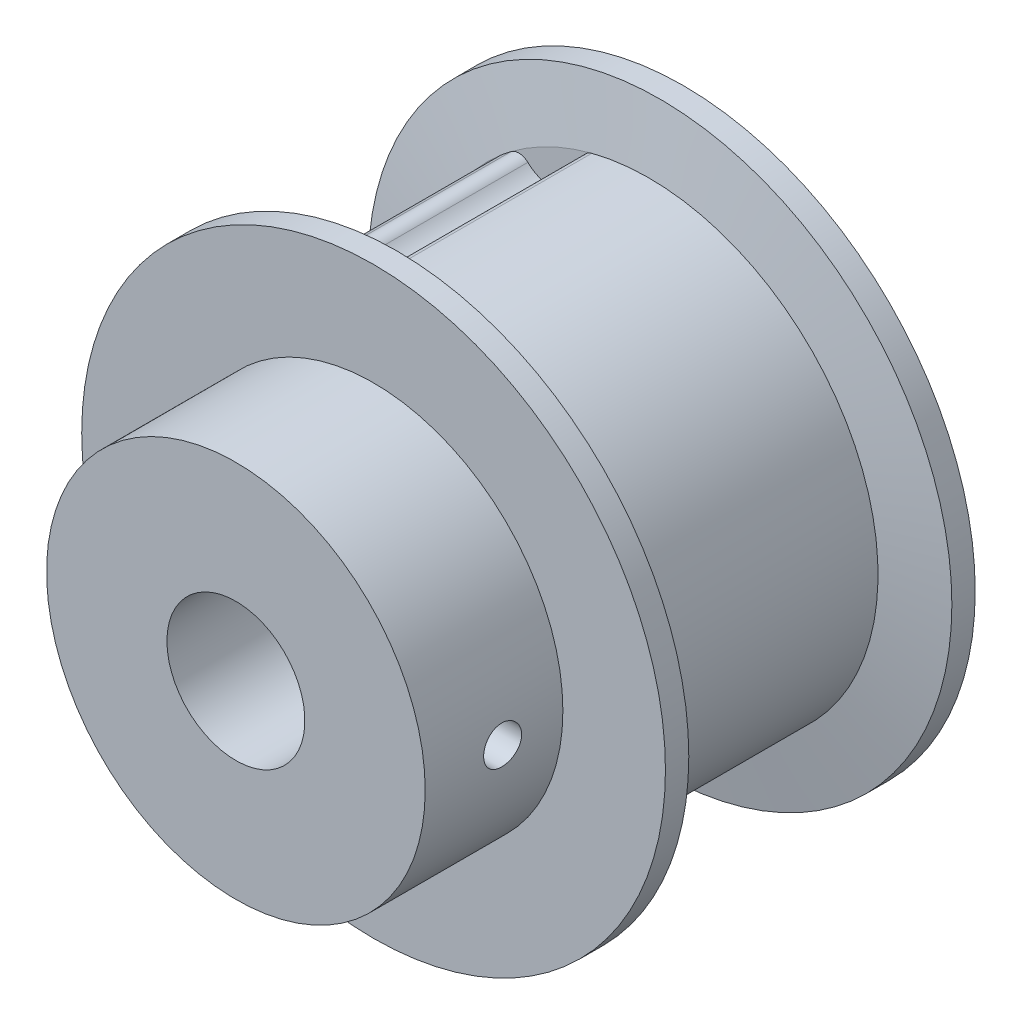
ISO-10303-21;
HEADER;
FILE_DESCRIPTION(('STEP AP214'),'2;1');
FILE_NAME('part.step','',(''),(''),'','','');
FILE_SCHEMA(('AUTOMOTIVE_DESIGN { 1 0 10303 214 1 1 1 1 }'));
ENDSEC;
DATA;
#1=APPLICATION_CONTEXT('core data for automotive mechanical design processes');
#2=APPLICATION_PROTOCOL_DEFINITION('international standard','automotive_design',2000,#1);
#3=PRODUCT_CONTEXT('',#1,'mechanical');
#4=PRODUCT('Part','Part','',(#3));
#5=PRODUCT_RELATED_PRODUCT_CATEGORY('part','',(#4));
#6=PRODUCT_DEFINITION_FORMATION('','',#4);
#7=PRODUCT_DEFINITION_CONTEXT('part definition',#1,'design');
#8=PRODUCT_DEFINITION('design','',#6,#7);
#9=PRODUCT_DEFINITION_SHAPE('','',#8);
#10=(LENGTH_UNIT() NAMED_UNIT(*) SI_UNIT(.MILLI.,.METRE.));
#11=(NAMED_UNIT(*) PLANE_ANGLE_UNIT() SI_UNIT($,.RADIAN.));
#12=(NAMED_UNIT(*) SI_UNIT($,.STERADIAN.) SOLID_ANGLE_UNIT());
#13=UNCERTAINTY_MEASURE_WITH_UNIT(LENGTH_MEASURE(1.E-05),#10,'distance_accuracy_value','');
#14=(GEOMETRIC_REPRESENTATION_CONTEXT(3) GLOBAL_UNCERTAINTY_ASSIGNED_CONTEXT((#13)) GLOBAL_UNIT_ASSIGNED_CONTEXT((#10,
#11,#12)) REPRESENTATION_CONTEXT('',''));
#15=CARTESIAN_POINT('',(0.,0.,0.));
#16=DIRECTION('',(0.,0.,1.));
#17=DIRECTION('',(1.,0.,0.));
#18=AXIS2_PLACEMENT_3D('',#15,#16,#17);
#19=CARTESIAN_POINT('',(0.,0.,13.49375));
#20=DIRECTION('',(0.,0.,1.));
#21=DIRECTION('',(1.,0.,0.));
#22=AXIS2_PLACEMENT_3D('',#19,#20,#21);
#23=PLANE('',#22);
#24=CARTESIAN_POINT('',(0.,0.,13.49375));
#25=DIRECTION('',(0.,0.,-1.));
#26=DIRECTION('',(-1.,0.,0.));
#27=AXIS2_PLACEMENT_3D('',#24,#25,#26);
#28=CIRCLE('',#27,3.18135);
#29=CARTESIAN_POINT('',(-3.18135,0.,13.49375));
#30=VERTEX_POINT('',#29);
#31=EDGE_CURVE('E430',#30,#30,#28,.T.);
#32=ORIENTED_EDGE('',*,*,#31,.T.);
#33=EDGE_LOOP('',(#32));
#34=FACE_BOUND('',#33,.T.);
#35=CARTESIAN_POINT('',(0.,0.,13.49375));
#36=DIRECTION('',(0.,0.,1.));
#37=DIRECTION('',(1.,0.,0.));
#38=AXIS2_PLACEMENT_3D('',#35,#36,#37);
#39=CIRCLE('',#38,8.73125);
#40=CARTESIAN_POINT('',(8.73125,0.,13.49375));
#41=VERTEX_POINT('',#40);
#42=EDGE_CURVE('E257',#41,#41,#39,.F.);
#43=ORIENTED_EDGE('',*,*,#42,.F.);
#44=EDGE_LOOP('',(#43));
#45=FACE_BOUND('',#44,.T.);
#46=ADVANCED_FACE('F16',(#34,#45),#23,.T.);
#47=CARTESIAN_POINT('',(0.,0.,9.921875));
#48=DIRECTION('',(-1.,0.,0.));
#49=DIRECTION('',(0.,0.,1.));
#50=AXIS2_PLACEMENT_3D('',#47,#48,#49);
#51=CYLINDRICAL_SURFACE('',#50,0.8763);
#52=CARTESIAN_POINT('',(3.18135,0.,9.045575));
#53=CARTESIAN_POINT('',(3.18134841128343,-0.0481893943951871,9.04557754429007));
#54=CARTESIAN_POINT('',(3.18024298845227,-0.0964335547292547,9.04956791922159));
#55=CARTESIAN_POINT('',(3.1759353654732,-0.191573484811042,9.06540831663995));
#56=CARTESIAN_POINT('',(3.17272934101652,-0.238466632063338,9.077272674836));
#57=CARTESIAN_POINT('',(3.16457466220837,-0.329449970853951,9.10844309631712));
#58=CARTESIAN_POINT('',(3.15962928961197,-0.373545257646135,9.12773515166962));
#59=CARTESIAN_POINT('',(3.14851760225123,-0.457859625360472,9.17316920470743));
#60=CARTESIAN_POINT('',(3.14235155403727,-0.498079549672782,9.19930970734763));
#61=CARTESIAN_POINT('',(3.12929072619131,-0.574513195352826,9.25838377064851));
#62=CARTESIAN_POINT('',(3.12238278346796,-0.61061784951194,9.2914555529729));
#63=CARTESIAN_POINT('',(3.1086994626396,-0.676846842823859,9.36315970856861));
#64=CARTESIAN_POINT('',(3.10192411036523,-0.706970026947473,9.40179315332408));
#65=CARTESIAN_POINT('',(3.08913865023835,-0.760917411740671,9.48440057553412));
#66=CARTESIAN_POINT('',(3.08314497886407,-0.784615059156058,9.52845997873882));
#67=CARTESIAN_POINT('',(3.07279466027877,-0.824222549668575,9.62012938590107));
#68=CARTESIAN_POINT('',(3.06843767702726,-0.840133991612145,9.66773865860032));
#69=CARTESIAN_POINT('',(3.06198946318021,-0.86333728324876,9.76395087965073));
#70=CARTESIAN_POINT('',(3.05984641038301,-0.870826661539665,9.81250263053884));
#71=CARTESIAN_POINT('',(3.05791403428716,-0.877589320778472,9.91021715350185));
#72=CARTESIAN_POINT('',(3.05812424135696,-0.876864241055676,9.95937980170605));
#73=CARTESIAN_POINT('',(3.06082836184337,-0.86737498103517,10.0553625355372));
#74=CARTESIAN_POINT('',(3.06325376749431,-0.85885194837192,10.1022087022432));
#75=CARTESIAN_POINT('',(3.07000504534929,-0.834395708839866,10.1937792124117));
#76=CARTESIAN_POINT('',(3.07433108991607,-0.818461829897933,10.2385033630279));
#77=CARTESIAN_POINT('',(3.08445515923665,-0.779444059813929,10.3251798679962));
#78=CARTESIAN_POINT('',(3.09027014540672,-0.756277055716914,10.3670927434637));
#79=CARTESIAN_POINT('',(3.10270754980193,-0.703510106023451,10.4465171446987));
#80=CARTESIAN_POINT('',(3.10933008550084,-0.673909224003207,10.4840280285496));
#81=CARTESIAN_POINT('',(3.12291891433506,-0.607896089575789,10.5549560963033));
#82=CARTESIAN_POINT('',(3.12988915724795,-0.571282941371303,10.5881858040724));
#83=CARTESIAN_POINT('',(3.14318526025427,-0.492901554098853,10.64808641099));
#84=CARTESIAN_POINT('',(3.1495108435139,-0.451131117240939,10.6747544993008));
#85=CARTESIAN_POINT('',(3.1608491773403,-0.363305959994821,10.7208650491048));
#86=CARTESIAN_POINT('',(3.16585434053572,-0.317228455148668,10.7402660088295));
#87=CARTESIAN_POINT('',(3.1739253063138,-0.222350425059078,10.7709555571985));
#88=CARTESIAN_POINT('',(3.17699512787984,-0.173555773330067,10.7822609639702));
#89=CARTESIAN_POINT('',(3.17972928272051,-0.103619486643986,10.7922759282538));
#90=CARTESIAN_POINT('',(3.18033546992572,-0.082965325340154,10.7944857857713));
#91=CARTESIAN_POINT('',(3.18114617161247,-0.0415441698215398,10.7974358721658));
#92=CARTESIAN_POINT('',(3.18135068498563,-0.0207771752955613,10.7981760969875));
#93=CARTESIAN_POINT('',(3.18134841128344,0.0481893943951848,10.7981724557099));
#94=CARTESIAN_POINT('',(3.18024298845228,0.0964335547292519,10.7941820807784));
#95=CARTESIAN_POINT('',(3.1759353654732,0.19157348481104,10.77834168336));
#96=CARTESIAN_POINT('',(3.17272934101652,0.238466632063337,10.766477325164));
#97=CARTESIAN_POINT('',(3.16457466220837,0.329449970853952,10.7353069036829));
#98=CARTESIAN_POINT('',(3.15962928961197,0.373545257646136,10.7160148483304));
#99=CARTESIAN_POINT('',(3.14851760225123,0.457859625360474,10.6705807952926));
#100=CARTESIAN_POINT('',(3.14235155403727,0.498079549672782,10.6444402926524));
#101=CARTESIAN_POINT('',(3.12929072619131,0.574513195352826,10.5853662293515));
#102=CARTESIAN_POINT('',(3.12238278346796,0.61061784951194,10.5522944470271));
#103=CARTESIAN_POINT('',(3.1086994626396,0.676846842823859,10.4805902914314));
#104=CARTESIAN_POINT('',(3.10192411036523,0.706970026947473,10.4419568466759));
#105=CARTESIAN_POINT('',(3.08913865023835,0.760917411740671,10.3593494244659));
#106=CARTESIAN_POINT('',(3.08314497886407,0.784615059156057,10.3152900212612));
#107=CARTESIAN_POINT('',(3.07279466027877,0.824222549668575,10.2236206140989));
#108=CARTESIAN_POINT('',(3.06843767702726,0.840133991612145,10.1760113413997));
#109=CARTESIAN_POINT('',(3.06198946318021,0.86333728324876,10.0797991203493));
#110=CARTESIAN_POINT('',(3.05984641038301,0.870826661539665,10.0312473694612));
#111=CARTESIAN_POINT('',(3.05791403428716,0.877589320778472,9.93353284649815));
#112=CARTESIAN_POINT('',(3.05812424135696,0.876864241055676,9.88437019829395));
#113=CARTESIAN_POINT('',(3.06082836184337,0.86737498103517,9.78838746446278));
#114=CARTESIAN_POINT('',(3.06325376749431,0.858851948371921,9.74154129775683));
#115=CARTESIAN_POINT('',(3.07000504534929,0.834395708839867,9.64997078758832));
#116=CARTESIAN_POINT('',(3.07433108991607,0.818461829897933,9.60524663697213));
#117=CARTESIAN_POINT('',(3.08445515923665,0.779444059813929,9.51857013200384));
#118=CARTESIAN_POINT('',(3.09027014540672,0.756277055716915,9.47665725653625));
#119=CARTESIAN_POINT('',(3.10270754980193,0.703510106023452,9.39723285530135));
#120=CARTESIAN_POINT('',(3.10933008550084,0.673909224003207,9.35972197145043));
#121=CARTESIAN_POINT('',(3.12291891433506,0.607896089575789,9.28879390369665));
#122=CARTESIAN_POINT('',(3.12988915724795,0.571282941371303,9.25556419592761));
#123=CARTESIAN_POINT('',(3.14318526025427,0.492901554098853,9.19566358901004));
#124=CARTESIAN_POINT('',(3.1495108435139,0.451131117240939,9.16899550069922));
#125=CARTESIAN_POINT('',(3.1608491773403,0.363305959994821,9.12288495089521));
#126=CARTESIAN_POINT('',(3.16585434053572,0.317228455148668,9.10348399117052));
#127=CARTESIAN_POINT('',(3.1739253063138,0.222350425059077,9.07279444280147));
#128=CARTESIAN_POINT('',(3.17699512787984,0.173555773330066,9.06148903602985));
#129=CARTESIAN_POINT('',(3.17972928272051,0.103619486643986,9.05147407174618));
#130=CARTESIAN_POINT('',(3.18033546992572,0.0829653253401542,9.04926421422868));
#131=CARTESIAN_POINT('',(3.18114617161247,0.0415441698215395,9.04631412783419));
#132=CARTESIAN_POINT('',(3.18135068498563,0.0207771752955602,9.04557390301255));
#133=CARTESIAN_POINT('',(3.18135,0.,9.045575));
#134=B_SPLINE_CURVE_WITH_KNOTS('',3,(#52,#53,#54,#55,#56,#57,#58,#59,#60,#61,#62,#63,#64,#65,
#66,#67,#68,#69,#70,#71,#72,#73,#74,#75,#76,#77,#78,#79,#80,#81,#82,#83,#84,#85,#86,#87,#88,#89,
#90,#91,#92,#93,#94,#95,#96,#97,#98,#99,#100,#101,#102,#103,#104,#105,#106,#107,#108,#109,#110,
#111,#112,#113,#114,#115,#116,#117,#118,#119,#120,#121,#122,#123,#124,#125,#126,#127,#128,#129,
#130,#131,#132,#133),.UNSPECIFIED.,.T.,.F.,(4,2,2,2,2,2,2,2,2,2,2,2,2,2,2,2,2,2,2,2,2,2,2,2,2,2,
2,2,2,2,2,2,2,2,2,2,2,2,2,2,4),(0.,0.144488377736948,0.289240541482826,0.433721043074943,
0.578170030204596,0.725833451323394,0.873525358759691,1.02394383604916,1.17433141291198,
1.32111306899122,1.46786543290902,1.61022753532876,1.75260255076833,1.8966778057285,
2.04077404429288,2.18987597815134,2.33904167287127,2.48904669860112,2.63873918472978,
2.7010361300674,2.76333324730844,2.90782162504539,3.05257378879127,3.19705429038339,
3.34150327751304,3.48916669863184,3.63685860606813,3.78727708335761,3.93766466022042,
4.08444631629966,4.23119868021747,4.3735607826372,4.51593579807677,4.66001105303694,
4.80410729160133,4.95320922545978,5.10237492017971,5.25237994590956,5.40207243203822,
5.46436937737585,5.52666649461689),.UNSPECIFIED.);
#135=CARTESIAN_POINT('',(3.18135,0.,9.045575));
#136=VERTEX_POINT('',#135);
#137=EDGE_CURVE('E19',#136,#136,#134,.T.);
#138=ORIENTED_EDGE('',*,*,#137,.T.);
#139=EDGE_LOOP('',(#138));
#140=FACE_BOUND('',#139,.T.);
#141=CARTESIAN_POINT('',(8.73125,0.,10.798175));
#142=CARTESIAN_POINT('',(8.73124910036505,0.0490599260598818,10.7981710471338));
#143=CARTESIAN_POINT('',(8.73083194377037,0.0981611052276523,10.7940398514306));
#144=CARTESIAN_POINT('',(8.72920628542201,0.195047567693096,10.7776092950651));
#145=CARTESIAN_POINT('',(8.72799612106251,0.242829866020774,10.7652927724224));
#146=CARTESIAN_POINT('',(8.72492138404998,0.335596285002959,10.7328543844939));
#147=CARTESIAN_POINT('',(8.72305745719067,0.380583115615679,10.7127402197469));
#148=CARTESIAN_POINT('',(8.71888396161317,0.466521240776585,10.6652916869772));
#149=CARTESIAN_POINT('',(8.71657458734335,0.507474284427691,10.6379604674561));
#150=CARTESIAN_POINT('',(8.71175897568934,0.584356974756563,10.576742225632));
#151=CARTESIAN_POINT('',(8.70925211089828,0.620269513468087,10.5428337647352));
#152=CARTESIAN_POINT('',(8.70432914759082,0.685905822298732,10.4694677969302));
#153=CARTESIAN_POINT('',(8.70191305772755,0.71562900363734,10.4300097627005));
#154=CARTESIAN_POINT('',(8.69743915546719,0.76809901236908,10.3465628060867));
#155=CARTESIAN_POINT('',(8.69538211255125,0.790830934149677,10.3025644665244));
#156=CARTESIAN_POINT('',(8.69186671880915,0.828577701415579,10.2113515062519));
#157=CARTESIAN_POINT('',(8.69040834786573,0.843592806214576,10.1641369936774));
#158=CARTESIAN_POINT('',(8.6882608950464,0.865430771221417,10.0680009563374));
#159=CARTESIAN_POINT('',(8.68756922722907,0.872281175303693,10.0190857470887));
#160=CARTESIAN_POINT('',(8.68702546344219,0.877680421406713,9.9207952575065));
#161=CARTESIAN_POINT('',(8.6871733467379,0.876229468449398,9.87141998856539));
#162=CARTESIAN_POINT('',(8.68828961316532,0.865089912220661,9.77380140890658));
#163=CARTESIAN_POINT('',(8.68925499285887,0.855431462401511,9.72555461810784));
#164=CARTESIAN_POINT('',(8.69189279949484,0.828197853454266,9.63136986202329));
#165=CARTESIAN_POINT('',(8.69356524248193,0.810622514675772,9.58543194915694));
#166=CARTESIAN_POINT('',(8.69743225435607,0.768020037687419,9.49707271573068));
#167=CARTESIAN_POINT('',(8.69962777664596,0.742979271243872,9.45465800946672));
#168=CARTESIAN_POINT('',(8.70429252590947,0.686168851401518,9.3746254294583));
#169=CARTESIAN_POINT('',(8.70676173833957,0.654399555465836,9.33700730105853));
#170=CARTESIAN_POINT('',(8.71170872306345,0.584871615147312,9.26746316235356));
#171=CARTESIAN_POINT('',(8.7141864871327,0.547088088119497,9.23556202486407));
#172=CARTESIAN_POINT('',(8.71886266553508,0.466669026701758,9.17853652384356));
#173=CARTESIAN_POINT('',(8.72106095019883,0.424031257364837,9.1534152999471));
#174=CARTESIAN_POINT('',(8.72493154178951,0.335081528024233,9.11066557515421));
#175=CARTESIAN_POINT('',(8.72660332211766,0.288765947140964,9.09304456967051));
#176=CARTESIAN_POINT('',(8.72922523155603,0.193889002865032,9.06587576932256));
#177=CARTESIAN_POINT('',(8.7301768908388,0.145332635307131,9.05631085129871));
#178=CARTESIAN_POINT('',(8.73107197375254,0.0643625993434024,9.04734667207088));
#179=CARTESIAN_POINT('',(8.73125059028648,0.0321901798094672,9.0455724063664));
#180=CARTESIAN_POINT('',(8.73124910036505,-0.0490599260598827,9.04557895286617));
#181=CARTESIAN_POINT('',(8.73083194377037,-0.0981611052276533,9.04971014856944));
#182=CARTESIAN_POINT('',(8.72920628542201,-0.195047567693097,9.06614070493494));
#183=CARTESIAN_POINT('',(8.72799612106251,-0.242829866020775,9.07845722757756));
#184=CARTESIAN_POINT('',(8.72492138404998,-0.33559628500296,9.11089561550606));
#185=CARTESIAN_POINT('',(8.72305745719067,-0.38058311561568,9.13100978025305));
#186=CARTESIAN_POINT('',(8.71888396161317,-0.466521240776586,9.17845831302283));
#187=CARTESIAN_POINT('',(8.71657458734335,-0.507474284427691,9.20578953254394));
#188=CARTESIAN_POINT('',(8.71175897568934,-0.584356974756564,9.26700777436799));
#189=CARTESIAN_POINT('',(8.70925211089828,-0.620269513468089,9.3009162352648));
#190=CARTESIAN_POINT('',(8.70432914759082,-0.685905822298734,9.37428220306979));
#191=CARTESIAN_POINT('',(8.70191305772755,-0.715629003637341,9.41374023729953));
#192=CARTESIAN_POINT('',(8.69743915546719,-0.76809901236908,9.49718719391333));
#193=CARTESIAN_POINT('',(8.69538211255125,-0.790830934149677,9.54118553347561));
#194=CARTESIAN_POINT('',(8.69186671880915,-0.828577701415579,9.63239849374809));
#195=CARTESIAN_POINT('',(8.69040834786573,-0.843592806214576,9.67961300632256));
#196=CARTESIAN_POINT('',(8.6882608950464,-0.865430771221417,9.77574904366259));
#197=CARTESIAN_POINT('',(8.68756922722907,-0.872281175303693,9.82466425291132));
#198=CARTESIAN_POINT('',(8.68702546344219,-0.877680421406713,9.9229547424935));
#199=CARTESIAN_POINT('',(8.6871733467379,-0.876229468449398,9.97233001143461));
#200=CARTESIAN_POINT('',(8.68828961316532,-0.865089912220661,10.0699485910934));
#201=CARTESIAN_POINT('',(8.68925499285887,-0.855431462401511,10.1181953818922));
#202=CARTESIAN_POINT('',(8.69189279949484,-0.828197853454266,10.2123801379767));
#203=CARTESIAN_POINT('',(8.69356524248193,-0.810622514675772,10.2583180508431));
#204=CARTESIAN_POINT('',(8.69743225435607,-0.768020037687419,10.3466772842693));
#205=CARTESIAN_POINT('',(8.69962777664596,-0.742979271243872,10.3890919905333));
#206=CARTESIAN_POINT('',(8.70429252590947,-0.686168851401518,10.4691245705417));
#207=CARTESIAN_POINT('',(8.70676173833957,-0.654399555465835,10.5067426989415));
#208=CARTESIAN_POINT('',(8.71170872306345,-0.584871615147311,10.5762868376464));
#209=CARTESIAN_POINT('',(8.7141864871327,-0.547088088119496,10.6081879751359));
#210=CARTESIAN_POINT('',(8.71886266553508,-0.466669026701757,10.6652134761564));
#211=CARTESIAN_POINT('',(8.72106095019883,-0.424031257364837,10.6903347000529));
#212=CARTESIAN_POINT('',(8.72493154178951,-0.335081528024233,10.7330844248458));
#213=CARTESIAN_POINT('',(8.72660332211766,-0.288765947140964,10.7507054303295));
#214=CARTESIAN_POINT('',(8.72922523155603,-0.193889002865031,10.7778742306774));
#215=CARTESIAN_POINT('',(8.7301768908388,-0.145332635307131,10.7874391487013));
#216=CARTESIAN_POINT('',(8.73107197375254,-0.0643625993434024,10.7964033279291));
#217=CARTESIAN_POINT('',(8.73125059028648,-0.0321901798094676,10.7981775936336));
#218=CARTESIAN_POINT('',(8.73125,0.,10.798175));
#219=B_SPLINE_CURVE_WITH_KNOTS('',3,(#141,#142,#143,#144,#145,#146,#147,#148,#149,#150,#151,
#152,#153,#154,#155,#156,#157,#158,#159,#160,#161,#162,#163,#164,#165,#166,#167,#168,#169,#170,
#171,#172,#173,#174,#175,#176,#177,#178,#179,#180,#181,#182,#183,#184,#185,#186,#187,#188,#189,
#190,#191,#192,#193,#194,#195,#196,#197,#198,#199,#200,#201,#202,#203,#204,#205,#206,#207,#208,
#209,#210,#211,#212,#213,#214,#215,#216,#217,#218),.UNSPECIFIED.,.T.,.F.,(4,2,2,2,2,2,2,2,2,2,2,
2,2,2,2,2,2,2,2,2,2,2,2,2,2,2,2,2,2,2,2,2,2,2,2,2,2,2,4),(0.,0.147077343312324,
0.294464037196071,0.441705549038897,0.588882931338588,0.73654835573108,0.884227820813253,
1.03221999529279,1.18020719636078,1.32769373195796,1.47517662503679,1.62212001295694,
1.76906673549103,1.91628337105351,2.06349218747452,2.21132668633078,2.359229527208,
2.50727983108364,2.65501465517008,2.75151798298479,2.89859532629711,3.04598202018086,
3.19322353202369,3.34040091432338,3.48806633871587,3.63574580379804,3.78373797827758,
3.93172517934557,4.07921171494276,4.22669460802158,4.37363799594173,4.52058471847582,
4.66780135403831,4.81501017045931,4.96284466931557,5.11074751019279,5.25879781406843,
5.40653263815486,5.50303596596958),.UNSPECIFIED.);
#220=CARTESIAN_POINT('',(8.73125,0.,10.798175));
#221=VERTEX_POINT('',#220);
#222=EDGE_CURVE('E134',#221,#221,#219,.T.);
#223=ORIENTED_EDGE('',*,*,#222,.F.);
#224=EDGE_LOOP('',(#223));
#225=FACE_BOUND('',#224,.T.);
#226=ADVANCED_FACE('F258',(#140,#225),#51,.F.);
#227=CARTESIAN_POINT('',(0.,0.,-6.67350464587232));
#228=DIRECTION('',(0.,0.,1.));
#229=DIRECTION('',(1.,0.,0.));
#230=AXIS2_PLACEMENT_3D('',#227,#228,#229);
#231=CYLINDRICAL_SURFACE('',#230,10.5664);
#232=DIRECTION('',(0.,0.,1.));
#233=VECTOR('',#232,1.);
#234=CARTESIAN_POINT('',(-6.81279382708512,8.07679696597752,5.55625));
#235=LINE('',#234,#233);
#236=CARTESIAN_POINT('',(-6.81279382793805,8.07679696525829,5.55625));
#237=VERTEX_POINT('',#236);
#238=CARTESIAN_POINT('',(-6.81279382793805,8.07679696525829,-5.55625));
#239=VERTEX_POINT('',#238);
#240=EDGE_CURVE('E152',#237,#239,#235,.F.);
#241=ORIENTED_EDGE('',*,*,#240,.F.);
#242=CARTESIAN_POINT('',(0.,0.,5.55625));
#243=DIRECTION('',(0.,0.,1.));
#244=DIRECTION('',(1.,0.,0.));
#245=AXIS2_PLACEMENT_3D('',#242,#243,#244);
#246=CIRCLE('',#245,10.5664);
#247=CARTESIAN_POINT('',(-6.35830555701132,8.43923926688077,5.55624999999999));
#248=VERTEX_POINT('',#247);
#249=EDGE_CURVE('E140',#237,#248,#246,.F.);
#250=ORIENTED_EDGE('',*,*,#249,.T.);
#251=DIRECTION('',(0.,0.,1.));
#252=VECTOR('',#251,1.);
#253=CARTESIAN_POINT('',(-6.35830555790211,8.43923926620915,5.55625));
#254=LINE('',#253,#252);
#255=CARTESIAN_POINT('',(-6.3583055570118,8.4392392668814,-5.55625));
#256=VERTEX_POINT('',#255);
#257=EDGE_CURVE('E149',#256,#248,#254,.T.);
#258=ORIENTED_EDGE('',*,*,#257,.F.);
#259=CARTESIAN_POINT('',(0.,0.,-5.55625));
#260=DIRECTION('',(0.,0.,1.));
#261=DIRECTION('',(1.,0.,0.));
#262=AXIS2_PLACEMENT_3D('',#259,#260,#261);
#263=CIRCLE('',#262,10.5664);
#264=EDGE_CURVE('E155',#256,#239,#263,.T.);
#265=ORIENTED_EDGE('',*,*,#264,.T.);
#266=EDGE_LOOP('',(#241,#250,#258,#265));
#267=FACE_BOUND('',#266,.T.);
#268=ADVANCED_FACE('F148',(#267),#231,.T.);
#269=CARTESIAN_POINT('',(0.,0.,-6.67350464587232));
#270=DIRECTION('',(0.,0.,1.));
#271=DIRECTION('',(1.,0.,0.));
#272=AXIS2_PLACEMENT_3D('',#269,#270,#271);
#273=CYLINDRICAL_SURFACE('',#272,10.5664);
#274=CARTESIAN_POINT('',(0.,0.,-5.55625));
#275=DIRECTION('',(0.,0.,1.));
#276=DIRECTION('',(1.,0.,0.));
#277=AXIS2_PLACEMENT_3D('',#274,#275,#276);
#278=CIRCLE('',#277,10.5664);
#279=CARTESIAN_POINT('',(-9.39028404790058,4.84472645871151,-5.55625));
#280=VERTEX_POINT('',#279);
#281=CARTESIAN_POINT('',(-9.64250600978946,4.32098215816429,-5.55625));
#282=VERTEX_POINT('',#281);
#283=EDGE_CURVE('E388',#280,#282,#278,.T.);
#284=ORIENTED_EDGE('',*,*,#283,.T.);
#285=DIRECTION('',(0.,0.,1.));
#286=VECTOR('',#285,1.);
#287=CARTESIAN_POINT('',(-9.64250600933228,4.32098215918119,5.55625));
#288=LINE('',#287,#286);
#289=CARTESIAN_POINT('',(-9.64250600978946,4.32098215816429,5.55625));
#290=VERTEX_POINT('',#289);
#291=EDGE_CURVE('E244',#290,#282,#288,.F.);
#292=ORIENTED_EDGE('',*,*,#291,.F.);
#293=CARTESIAN_POINT('',(0.,0.,5.55625));
#294=DIRECTION('',(0.,0.,1.));
#295=DIRECTION('',(1.,0.,0.));
#296=AXIS2_PLACEMENT_3D('',#293,#294,#295);
#297=CIRCLE('',#296,10.5664);
#298=CARTESIAN_POINT('',(-9.39028404790029,4.84472645871136,5.55625));
#299=VERTEX_POINT('',#298);
#300=EDGE_CURVE('E154',#290,#299,#297,.F.);
#301=ORIENTED_EDGE('',*,*,#300,.T.);
#302=DIRECTION('',(0.,0.,1.));
#303=VECTOR('',#302,1.);
#304=CARTESIAN_POINT('',(-9.39028404841109,4.84472645772086,5.55625));
#305=LINE('',#304,#303);
#306=EDGE_CURVE('E165',#280,#299,#305,.T.);
#307=ORIENTED_EDGE('',*,*,#306,.F.);
#308=EDGE_LOOP('',(#284,#292,#301,#307));
#309=FACE_BOUND('',#308,.T.);
#310=ADVANCED_FACE('F271',(#309),#273,.T.);
#311=CARTESIAN_POINT('',(0.,0.,13.49375));
#312=DIRECTION('',(0.,0.,-1.));
#313=DIRECTION('',(-1.,0.,0.));
#314=AXIS2_PLACEMENT_3D('',#311,#312,#313);
#315=CYLINDRICAL_SURFACE('',#314,3.18135);
#316=ORIENTED_EDGE('',*,*,#31,.F.);
#317=EDGE_LOOP('',(#316));
#318=FACE_BOUND('',#317,.T.);
#319=CARTESIAN_POINT('',(0.,0.,-7.14375));
#320=DIRECTION('',(0.,0.,-1.));
#321=DIRECTION('',(-1.,0.,0.));
#322=AXIS2_PLACEMENT_3D('',#319,#320,#321);
#323=CIRCLE('',#322,3.18135);
#324=CARTESIAN_POINT('',(-3.18135,0.,-7.14375));
#325=VERTEX_POINT('',#324);
#326=EDGE_CURVE('E236',#325,#325,#323,.T.);
#327=ORIENTED_EDGE('',*,*,#326,.T.);
#328=EDGE_LOOP('',(#327));
#329=FACE_BOUND('',#328,.T.);
#330=ORIENTED_EDGE('',*,*,#137,.F.);
#331=EDGE_LOOP('',(#330));
#332=FACE_BOUND('',#331,.T.);
#333=ADVANCED_FACE('F265',(#318,#329,#332),#315,.F.);
#334=CARTESIAN_POINT('',(0.,0.,7.14375));
#335=DIRECTION('',(0.,0.,1.));
#336=DIRECTION('',(1.,0.,0.));
#337=AXIS2_PLACEMENT_3D('',#334,#335,#336);
#338=CYLINDRICAL_SURFACE('',#337,8.73125);
#339=CARTESIAN_POINT('',(0.,0.,7.14375));
#340=DIRECTION('',(0.,0.,1.));
#341=DIRECTION('',(1.,0.,0.));
#342=AXIS2_PLACEMENT_3D('',#339,#340,#341);
#343=CIRCLE('',#342,8.73125);
#344=CARTESIAN_POINT('',(8.73125,0.,7.14375));
#345=VERTEX_POINT('',#344);
#346=EDGE_CURVE('E232',#345,#345,#343,.F.);
#347=ORIENTED_EDGE('',*,*,#346,.F.);
#348=EDGE_LOOP('',(#347));
#349=FACE_BOUND('',#348,.T.);
#350=ORIENTED_EDGE('',*,*,#42,.T.);
#351=EDGE_LOOP('',(#350));
#352=FACE_BOUND('',#351,.T.);
#353=ORIENTED_EDGE('',*,*,#222,.T.);
#354=EDGE_LOOP('',(#353));
#355=FACE_BOUND('',#354,.T.);
#356=ADVANCED_FACE('F261',(#349,#352,#355),#338,.T.);
#357=CARTESIAN_POINT('',(-5.99759399091706,7.960474732181,5.55625));
#358=DIRECTION('',(0.,0.,1.));
#359=DIRECTION('',(1.,0.,0.));
#360=AXIS2_PLACEMENT_3D('',#357,#358,#359);
#361=CYLINDRICAL_SURFACE('',#360,0.59944);
#362=CARTESIAN_POINT('',(-5.99759399091706,7.960474732181,-5.55625));
#363=DIRECTION('',(0.,0.,1.));
#364=DIRECTION('',(1.,0.,0.));
#365=AXIS2_PLACEMENT_3D('',#362,#363,#364);
#366=CIRCLE('',#365,0.59944);
#367=CARTESIAN_POINT('',(-5.58427408826013,8.39463480826761,-5.55625));
#368=VERTEX_POINT('',#367);
#369=EDGE_CURVE('E133',#368,#256,#366,.T.);
#370=ORIENTED_EDGE('',*,*,#369,.T.);
#371=ORIENTED_EDGE('',*,*,#257,.T.);
#372=CARTESIAN_POINT('',(-5.99759399091706,7.960474732181,5.55625));
#373=DIRECTION('',(0.,0.,1.));
#374=DIRECTION('',(1.,0.,0.));
#375=AXIS2_PLACEMENT_3D('',#372,#373,#374);
#376=CIRCLE('',#375,0.59944);
#377=CARTESIAN_POINT('',(-5.58427408826013,8.39463480826761,5.55625));
#378=VERTEX_POINT('',#377);
#379=EDGE_CURVE('E121',#248,#378,#376,.F.);
#380=ORIENTED_EDGE('',*,*,#379,.T.);
#381=DIRECTION('',(0.,0.,1.));
#382=VECTOR('',#381,1.);
#383=CARTESIAN_POINT('',(-5.58427408826038,8.3946348082677,5.55625));
#384=LINE('',#383,#382);
#385=EDGE_CURVE('E235',#378,#368,#384,.F.);
#386=ORIENTED_EDGE('',*,*,#385,.T.);
#387=EDGE_LOOP('',(#370,#371,#380,#386));
#388=FACE_BOUND('',#387,.T.);
#389=ADVANCED_FACE('F157',(#388),#361,.T.);
#390=CARTESIAN_POINT('',(-8.85756601008528,4.56988140093012,5.55625));
#391=DIRECTION('',(0.,0.,1.));
#392=DIRECTION('',(1.,0.,0.));
#393=AXIS2_PLACEMENT_3D('',#390,#391,#392);
#394=CYLINDRICAL_SURFACE('',#393,0.59944);
#395=CARTESIAN_POINT('',(-8.85756601008528,4.56988140093012,-5.55625));
#396=DIRECTION('',(0.,0.,1.));
#397=DIRECTION('',(1.,0.,0.));
#398=AXIS2_PLACEMENT_3D('',#395,#396,#397);
#399=CIRCLE('',#398,0.59944);
#400=CARTESIAN_POINT('',(-8.67355264249433,5.1403788979867,-5.55625));
#401=VERTEX_POINT('',#400);
#402=EDGE_CURVE('E160',#401,#280,#399,.T.);
#403=ORIENTED_EDGE('',*,*,#402,.T.);
#404=ORIENTED_EDGE('',*,*,#306,.T.);
#405=CARTESIAN_POINT('',(-8.85756601008528,4.56988140093012,5.55625));
#406=DIRECTION('',(0.,0.,1.));
#407=DIRECTION('',(1.,0.,0.));
#408=AXIS2_PLACEMENT_3D('',#405,#406,#407);
#409=CIRCLE('',#408,0.59944);
#410=CARTESIAN_POINT('',(-8.67355264249433,5.1403788979867,5.55625));
#411=VERTEX_POINT('',#410);
#412=EDGE_CURVE('E158',#299,#411,#409,.F.);
#413=ORIENTED_EDGE('',*,*,#412,.T.);
#414=DIRECTION('',(0.,0.,1.));
#415=VECTOR('',#414,1.);
#416=CARTESIAN_POINT('',(-8.67355264249442,5.14037889798672,5.55625));
#417=LINE('',#416,#415);
#418=EDGE_CURVE('E381',#411,#401,#417,.F.);
#419=ORIENTED_EDGE('',*,*,#418,.T.);
#420=EDGE_LOOP('',(#403,#404,#413,#419));
#421=FACE_BOUND('',#420,.T.);
#422=ADVANCED_FACE('F370',(#421),#394,.T.);
#423=CARTESIAN_POINT('',(-6.42629879427282,7.61859405981976,5.55625));
#424=DIRECTION('',(0.,0.,1.));
#425=DIRECTION('',(1.,0.,0.));
#426=AXIS2_PLACEMENT_3D('',#423,#424,#425);
#427=CYLINDRICAL_SURFACE('',#426,0.59944);
#428=DIRECTION('',(0.,0.,1.));
#429=VECTOR('',#428,1.);
#430=CARTESIAN_POINT('',(-6.94154590156664,7.31224665567665,5.55625));
#431=LINE('',#430,#429);
#432=CARTESIAN_POINT('',(-6.94154590156647,7.31224665567626,-5.55625));
#433=VERTEX_POINT('',#432);
#434=CARTESIAN_POINT('',(-6.94154590156647,7.31224665567626,5.55625));
#435=VERTEX_POINT('',#434);
#436=EDGE_CURVE('E412',#433,#435,#431,.T.);
#437=ORIENTED_EDGE('',*,*,#436,.T.);
#438=CARTESIAN_POINT('',(-6.42629879427282,7.61859405981976,5.55625));
#439=DIRECTION('',(0.,0.,1.));
#440=DIRECTION('',(1.,0.,0.));
#441=AXIS2_PLACEMENT_3D('',#438,#439,#440);
#442=CIRCLE('',#441,0.59944);
#443=EDGE_CURVE('E245',#435,#237,#442,.F.);
#444=ORIENTED_EDGE('',*,*,#443,.T.);
#445=ORIENTED_EDGE('',*,*,#240,.T.);
#446=CARTESIAN_POINT('',(-6.42629879427282,7.61859405981976,-5.55625));
#447=DIRECTION('',(0.,0.,1.));
#448=DIRECTION('',(1.,0.,0.));
#449=AXIS2_PLACEMENT_3D('',#446,#447,#448);
#450=CIRCLE('',#449,0.59944);
#451=EDGE_CURVE('E248',#239,#433,#450,.T.);
#452=ORIENTED_EDGE('',*,*,#451,.T.);
#453=EDGE_LOOP('',(#437,#444,#445,#452));
#454=FACE_BOUND('',#453,.T.);
#455=ADVANCED_FACE('F367',(#454),#427,.T.);
#456=CARTESIAN_POINT('',(-9.09547922697062,4.07584951553892,5.55625));
#457=DIRECTION('',(0.,0.,1.));
#458=DIRECTION('',(1.,0.,0.));
#459=AXIS2_PLACEMENT_3D('',#456,#457,#458);
#460=CYLINDRICAL_SURFACE('',#459,0.59944);
#461=DIRECTION('',(0.,0.,1.));
#462=VECTOR('',#461,1.);
#463=CARTESIAN_POINT('',(-9.42678167274081,3.57628270016176,5.55625));
#464=LINE('',#463,#462);
#465=CARTESIAN_POINT('',(-9.42678167274036,3.57628270016116,-5.55625));
#466=VERTEX_POINT('',#465);
#467=CARTESIAN_POINT('',(-9.42678167274036,3.57628270016116,5.55625));
#468=VERTEX_POINT('',#467);
#469=EDGE_CURVE('E231',#466,#468,#464,.T.);
#470=ORIENTED_EDGE('',*,*,#469,.T.);
#471=CARTESIAN_POINT('',(-9.09547922697062,4.07584951553892,5.55625));
#472=DIRECTION('',(0.,0.,1.));
#473=DIRECTION('',(1.,0.,0.));
#474=AXIS2_PLACEMENT_3D('',#471,#472,#473);
#475=CIRCLE('',#474,0.59944);
#476=EDGE_CURVE('E239',#468,#290,#475,.F.);
#477=ORIENTED_EDGE('',*,*,#476,.T.);
#478=ORIENTED_EDGE('',*,*,#291,.T.);
#479=CARTESIAN_POINT('',(-9.09547922697062,4.07584951553892,-5.55625));
#480=DIRECTION('',(0.,0.,1.));
#481=DIRECTION('',(1.,0.,0.));
#482=AXIS2_PLACEMENT_3D('',#479,#480,#481);
#483=CIRCLE('',#482,0.59944);
#484=EDGE_CURVE('E242',#282,#466,#483,.T.);
#485=ORIENTED_EDGE('',*,*,#484,.T.);
#486=EDGE_LOOP('',(#470,#477,#478,#485));
#487=FACE_BOUND('',#486,.T.);
#488=ADVANCED_FACE('F363',(#487),#460,.T.);
#489=CARTESIAN_POINT('',(0.,0.,-7.14375));
#490=DIRECTION('',(0.,0.,1.));
#491=DIRECTION('',(1.,0.,0.));
#492=AXIS2_PLACEMENT_3D('',#489,#490,#491);
#493=PLANE('',#492);
#494=ORIENTED_EDGE('',*,*,#326,.F.);
#495=EDGE_LOOP('',(#494));
#496=FACE_BOUND('',#495,.T.);
#497=CARTESIAN_POINT('',(0.,0.,-7.14375));
#498=DIRECTION('',(0.,0.,1.));
#499=DIRECTION('',(1.,0.,0.));
#500=AXIS2_PLACEMENT_3D('',#497,#498,#499);
#501=CIRCLE('',#500,13.462);
#502=CARTESIAN_POINT('',(13.462,0.,-7.14375));
#503=VERTEX_POINT('',#502);
#504=EDGE_CURVE('E216',#503,#503,#501,.T.);
#505=ORIENTED_EDGE('',*,*,#504,.F.);
#506=EDGE_LOOP('',(#505));
#507=FACE_BOUND('',#506,.T.);
#508=ADVANCED_FACE('F359',(#496,#507),#493,.F.);
#509=CARTESIAN_POINT('',(0.,0.,7.14375));
#510=DIRECTION('',(0.,0.,1.));
#511=DIRECTION('',(1.,0.,0.));
#512=AXIS2_PLACEMENT_3D('',#509,#510,#511);
#513=PLANE('',#512);
#514=ORIENTED_EDGE('',*,*,#346,.T.);
#515=EDGE_LOOP('',(#514));
#516=FACE_BOUND('',#515,.T.);
#517=CARTESIAN_POINT('',(0.,0.,7.14375));
#518=DIRECTION('',(0.,0.,1.));
#519=DIRECTION('',(1.,0.,0.));
#520=AXIS2_PLACEMENT_3D('',#517,#518,#519);
#521=CIRCLE('',#520,13.462);
#522=CARTESIAN_POINT('',(13.462,0.,7.14375));
#523=VERTEX_POINT('',#522);
#524=EDGE_CURVE('E204',#523,#523,#521,.F.);
#525=ORIENTED_EDGE('',*,*,#524,.F.);
#526=EDGE_LOOP('',(#525));
#527=FACE_BOUND('',#526,.T.);
#528=ADVANCED_FACE('F355',(#516,#527),#513,.T.);
#529=CARTESIAN_POINT('',(-4.41261724555812,9.62536824429232,5.55625));
#530=DIRECTION('',(0.,0.,1.));
#531=DIRECTION('',(1.,0.,0.));
#532=AXIS2_PLACEMENT_3D('',#529,#530,#531);
#533=CYLINDRICAL_SURFACE('',#532,1.69926);
#534=CARTESIAN_POINT('',(-4.41261724555812,9.62536824429232,-5.55625));
#535=DIRECTION('',(0.,0.,1.));
#536=DIRECTION('',(1.,0.,0.));
#537=AXIS2_PLACEMENT_3D('',#534,#535,#536);
#538=CIRCLE('',#537,1.69926);
#539=CARTESIAN_POINT('',(-3.86128292006528,8.01803660174445,-5.55625));
#540=VERTEX_POINT('',#539);
#541=EDGE_CURVE('E222',#368,#540,#538,.T.);
#542=ORIENTED_EDGE('',*,*,#541,.F.);
#543=ORIENTED_EDGE('',*,*,#385,.F.);
#544=CARTESIAN_POINT('',(-4.41261724555812,9.62536824429232,5.55625));
#545=DIRECTION('',(0.,0.,1.));
#546=DIRECTION('',(1.,0.,0.));
#547=AXIS2_PLACEMENT_3D('',#544,#545,#546);
#548=CIRCLE('',#547,1.69926);
#549=CARTESIAN_POINT('',(-3.86128292006528,8.01803660174445,5.55625));
#550=VERTEX_POINT('',#549);
#551=EDGE_CURVE('E128',#378,#550,#548,.T.);
#552=ORIENTED_EDGE('',*,*,#551,.T.);
#553=DIRECTION('',(0.,0.,1.));
#554=VECTOR('',#553,1.);
#555=CARTESIAN_POINT('',(-3.86128292006768,8.01803660174293,5.55625));
#556=LINE('',#555,#554);
#557=EDGE_CURVE('E210',#550,#540,#556,.F.);
#558=ORIENTED_EDGE('',*,*,#557,.T.);
#559=EDGE_LOOP('',(#542,#543,#552,#558));
#560=FACE_BOUND('',#559,.T.);
#561=ADVANCED_FACE('F351',(#560),#533,.F.);
#562=CARTESIAN_POINT('',(-8.1519215284332,6.75759426040548,5.55625));
#563=DIRECTION('',(0.,0.,1.));
#564=DIRECTION('',(1.,0.,0.));
#565=AXIS2_PLACEMENT_3D('',#562,#563,#564);
#566=CYLINDRICAL_SURFACE('',#565,1.69926);
#567=CARTESIAN_POINT('',(-8.1519215284332,6.75759426040548,-5.55625));
#568=DIRECTION('',(0.,0.,1.));
#569=DIRECTION('',(1.,0.,0.));
#570=AXIS2_PLACEMENT_3D('',#567,#568,#569);
#571=CIRCLE('',#570,1.69926);
#572=CARTESIAN_POINT('',(-6.95779140229249,5.5486534887205,-5.55625));
#573=VERTEX_POINT('',#572);
#574=EDGE_CURVE('E228',#401,#573,#571,.T.);
#575=ORIENTED_EDGE('',*,*,#574,.F.);
#576=ORIENTED_EDGE('',*,*,#418,.F.);
#577=CARTESIAN_POINT('',(-8.1519215284332,6.75759426040548,5.55625));
#578=DIRECTION('',(0.,0.,1.));
#579=DIRECTION('',(1.,0.,0.));
#580=AXIS2_PLACEMENT_3D('',#577,#578,#579);
#581=CIRCLE('',#580,1.69926);
#582=CARTESIAN_POINT('',(-6.95779140229249,5.5486534887205,5.55625));
#583=VERTEX_POINT('',#582);
#584=EDGE_CURVE('E199',#411,#583,#581,.T.);
#585=ORIENTED_EDGE('',*,*,#584,.T.);
#586=DIRECTION('',(0.,0.,1.));
#587=VECTOR('',#586,1.);
#588=CARTESIAN_POINT('',(-6.95779140229189,5.54865348872147,5.55625));
#589=LINE('',#588,#587);
#590=EDGE_CURVE('E415',#583,#573,#589,.F.);
#591=ORIENTED_EDGE('',*,*,#590,.T.);
#592=EDGE_LOOP('',(#575,#576,#585,#591));
#593=FACE_BOUND('',#592,.T.);
#594=ADVANCED_FACE('F347',(#593),#566,.F.);
#595=CARTESIAN_POINT('',(-8.40214045571596,6.44382964986128,5.55625));
#596=DIRECTION('',(0.,0.,1.));
#597=DIRECTION('',(1.,0.,0.));
#598=AXIS2_PLACEMENT_3D('',#595,#596,#597);
#599=CYLINDRICAL_SURFACE('',#598,1.69926);
#600=CARTESIAN_POINT('',(-8.40214045571596,6.44382964986128,-5.55625));
#601=DIRECTION('',(0.,0.,1.));
#602=DIRECTION('',(1.,0.,0.));
#603=AXIS2_PLACEMENT_3D('',#600,#601,#602);
#604=CIRCLE('',#603,1.69926);
#605=EDGE_CURVE('E225',#573,#433,#604,.T.);
#606=ORIENTED_EDGE('',*,*,#605,.F.);
#607=ORIENTED_EDGE('',*,*,#590,.F.);
#608=CARTESIAN_POINT('',(-8.40214045571596,6.44382964986128,5.55625));
#609=DIRECTION('',(0.,0.,1.));
#610=DIRECTION('',(1.,0.,0.));
#611=AXIS2_PLACEMENT_3D('',#608,#609,#610);
#612=CIRCLE('',#611,1.69926);
#613=EDGE_CURVE('E196',#583,#435,#612,.T.);
#614=ORIENTED_EDGE('',*,*,#613,.T.);
#615=ORIENTED_EDGE('',*,*,#436,.F.);
#616=EDGE_LOOP('',(#606,#607,#614,#615));
#617=FACE_BOUND('',#616,.T.);
#618=ADVANCED_FACE('F343',(#617),#599,.F.);
#619=CARTESIAN_POINT('',(-10.3659398770602,2.1601377870757,5.55625));
#620=DIRECTION('',(0.,0.,1.));
#621=DIRECTION('',(1.,0.,0.));
#622=AXIS2_PLACEMENT_3D('',#619,#620,#621);
#623=CYLINDRICAL_SURFACE('',#622,1.69926);
#624=CARTESIAN_POINT('',(-10.3659398770602,2.1601377870757,-5.55625));
#625=DIRECTION('',(0.,0.,1.));
#626=DIRECTION('',(1.,0.,0.));
#627=AXIS2_PLACEMENT_3D('',#624,#625,#626);
#628=CIRCLE('',#627,1.69926);
#629=CARTESIAN_POINT('',(-8.67622396557662,1.98029150249049,-5.55625));
#630=VERTEX_POINT('',#629);
#631=EDGE_CURVE('E211',#630,#466,#628,.T.);
#632=ORIENTED_EDGE('',*,*,#631,.F.);
#633=DIRECTION('',(0.,0.,1.));
#634=VECTOR('',#633,1.);
#635=CARTESIAN_POINT('',(-8.6762239655766,1.98029150249054,5.55625));
#636=LINE('',#635,#634);
#637=CARTESIAN_POINT('',(-8.67622396557662,1.98029150249049,5.55625));
#638=VERTEX_POINT('',#637);
#639=EDGE_CURVE('E184',#630,#638,#636,.T.);
#640=ORIENTED_EDGE('',*,*,#639,.T.);
#641=CARTESIAN_POINT('',(-10.3659398770602,2.1601377870757,5.55625));
#642=DIRECTION('',(0.,0.,1.));
#643=DIRECTION('',(1.,0.,0.));
#644=AXIS2_PLACEMENT_3D('',#641,#642,#643);
#645=CIRCLE('',#644,1.69926);
#646=EDGE_CURVE('E191',#638,#468,#645,.T.);
#647=ORIENTED_EDGE('',*,*,#646,.T.);
#648=ORIENTED_EDGE('',*,*,#469,.F.);
#649=EDGE_LOOP('',(#632,#640,#647,#648));
#650=FACE_BOUND('',#649,.T.);
#651=ADVANCED_FACE('F339',(#650),#623,.F.);
#652=CARTESIAN_POINT('',(0.,0.,-5.55625));
#653=DIRECTION('',(0.,0.,1.));
#654=DIRECTION('',(1.,0.,0.));
#655=AXIS2_PLACEMENT_3D('',#652,#653,#654);
#656=PLANE('',#655);
#657=ORIENTED_EDGE('',*,*,#451,.F.);
#658=CARTESIAN_POINT('',(0.,0.,-5.55624999999997));
#659=DIRECTION('',(0.,0.,-1.));
#660=DIRECTION('',(-1.,0.,0.));
#661=AXIS2_PLACEMENT_3D('',#658,#659,#660);
#662=CIRCLE('',#661,10.5663999999996);
#663=EDGE_CURVE('E181',#280,#239,#662,.T.);
#664=ORIENTED_EDGE('',*,*,#663,.F.);
#665=ORIENTED_EDGE('',*,*,#402,.F.);
#666=ORIENTED_EDGE('',*,*,#574,.T.);
#667=ORIENTED_EDGE('',*,*,#605,.T.);
#668=EDGE_LOOP('',(#657,#664,#665,#666,#667));
#669=FACE_BOUND('',#668,.T.);
#670=ADVANCED_FACE('F335',(#669),#656,.T.);
#671=CARTESIAN_POINT('',(0.,0.,-5.55625));
#672=DIRECTION('',(0.,0.,1.));
#673=DIRECTION('',(1.,0.,0.));
#674=AXIS2_PLACEMENT_3D('',#671,#672,#673);
#675=PLANE('',#674);
#676=CARTESIAN_POINT('',(-2.48431107198412,9.65238261462974,-5.55625));
#677=DIRECTION('',(0.,0.,1.));
#678=DIRECTION('',(1.,0.,0.));
#679=AXIS2_PLACEMENT_3D('',#676,#677,#678);
#680=CIRCLE('',#679,0.59944);
#681=CARTESIAN_POINT('',(-3.08145183211128,9.59993048221588,-5.55625));
#682=VERTEX_POINT('',#681);
#683=CARTESIAN_POINT('',(-2.63372427502882,10.2329030779692,-5.55624999999997));
#684=VERTEX_POINT('',#683);
#685=EDGE_CURVE('E219',#682,#684,#680,.F.);
#686=ORIENTED_EDGE('',*,*,#685,.T.);
#687=CARTESIAN_POINT('',(0.,0.,-5.55624999999994));
#688=DIRECTION('',(0.,0.,-1.));
#689=DIRECTION('',(-1.,0.,0.));
#690=AXIS2_PLACEMENT_3D('',#687,#688,#689);
#691=CIRCLE('',#690,10.5663999999994);
#692=EDGE_CURVE('E178',#256,#684,#691,.T.);
#693=ORIENTED_EDGE('',*,*,#692,.F.);
#694=ORIENTED_EDGE('',*,*,#369,.F.);
#695=ORIENTED_EDGE('',*,*,#541,.T.);
#696=CARTESIAN_POINT('',(-4.77419407162324,9.45124202210858,-5.55625));
#697=DIRECTION('',(0.,0.,1.));
#698=DIRECTION('',(1.,0.,0.));
#699=AXIS2_PLACEMENT_3D('',#696,#697,#698);
#700=CIRCLE('',#699,1.69926);
#701=EDGE_CURVE('E207',#540,#682,#700,.T.);
#702=ORIENTED_EDGE('',*,*,#701,.T.);
#703=EDGE_LOOP('',(#686,#693,#694,#695,#702));
#704=FACE_BOUND('',#703,.T.);
#705=ADVANCED_FACE('F331',(#704),#675,.T.);
#706=CARTESIAN_POINT('',(0.,0.,-7.14375));
#707=DIRECTION('',(0.,0.,1.));
#708=DIRECTION('',(1.,0.,0.));
#709=AXIS2_PLACEMENT_3D('',#706,#707,#708);
#710=CYLINDRICAL_SURFACE('',#709,13.462);
#711=ORIENTED_EDGE('',*,*,#504,.T.);
#712=EDGE_LOOP('',(#711));
#713=FACE_BOUND('',#712,.T.);
#714=CARTESIAN_POINT('',(0.,0.,-6.06682240534027));
#715=DIRECTION('',(0.,0.,-1.));
#716=DIRECTION('',(0.,-1.,0.));
#717=AXIS2_PLACEMENT_3D('',#714,#715,#716);
#718=CIRCLE('',#717,13.462);
#719=CARTESIAN_POINT('',(0.,-13.462,-6.06682240534027));
#720=VERTEX_POINT('',#719);
#721=EDGE_CURVE('E177',#720,#720,#718,.F.);
#722=ORIENTED_EDGE('',*,*,#721,.F.);
#723=EDGE_LOOP('',(#722));
#724=FACE_BOUND('',#723,.T.);
#725=ADVANCED_FACE('F327',(#713,#724),#710,.T.);
#726=CARTESIAN_POINT('',(0.,0.,-5.55625));
#727=DIRECTION('',(0.,0.,1.));
#728=DIRECTION('',(1.,0.,0.));
#729=AXIS2_PLACEMENT_3D('',#726,#727,#728);
#730=PLANE('',#729);
#731=ORIENTED_EDGE('',*,*,#484,.F.);
#732=CARTESIAN_POINT('',(0.,0.,-5.55625000000007));
#733=DIRECTION('',(0.,0.,-1.));
#734=DIRECTION('',(-1.,0.,0.));
#735=AXIS2_PLACEMENT_3D('',#732,#733,#734);
#736=CIRCLE('',#735,10.5664000000001);
#737=CARTESIAN_POINT('',(-10.5624016188268,0.290656158722514,-5.55625000000003));
#738=VERTEX_POINT('',#737);
#739=EDGE_CURVE('E174',#738,#282,#736,.T.);
#740=ORIENTED_EDGE('',*,*,#739,.F.);
#741=CARTESIAN_POINT('',(-9.9631884500374,0.274167012308262,-5.55625));
#742=DIRECTION('',(0.,0.,1.));
#743=DIRECTION('',(1.,0.,0.));
#744=AXIS2_PLACEMENT_3D('',#741,#742,#743);
#745=CIRCLE('',#744,0.59944);
#746=CARTESIAN_POINT('',(-10.04492772174,0.868007904350513,-5.55625));
#747=VERTEX_POINT('',#746);
#748=EDGE_CURVE('E214',#738,#747,#745,.F.);
#749=ORIENTED_EDGE('',*,*,#748,.T.);
#750=CARTESIAN_POINT('',(-10.2766377758451,2.55139585679168,-5.55625));
#751=DIRECTION('',(0.,0.,1.));
#752=DIRECTION('',(1.,0.,0.));
#753=AXIS2_PLACEMENT_3D('',#750,#751,#752);
#754=CIRCLE('',#753,1.69926);
#755=EDGE_CURVE('E185',#747,#630,#754,.T.);
#756=ORIENTED_EDGE('',*,*,#755,.T.);
#757=ORIENTED_EDGE('',*,*,#631,.T.);
#758=EDGE_LOOP('',(#731,#740,#749,#756,#757));
#759=FACE_BOUND('',#758,.T.);
#760=ADVANCED_FACE('F323',(#759),#730,.T.);
#761=CARTESIAN_POINT('',(-4.77419407162324,9.45124202210858,5.55625));
#762=DIRECTION('',(0.,0.,1.));
#763=DIRECTION('',(1.,0.,0.));
#764=AXIS2_PLACEMENT_3D('',#761,#762,#763);
#765=CYLINDRICAL_SURFACE('',#764,1.69926);
#766=ORIENTED_EDGE('',*,*,#701,.F.);
#767=ORIENTED_EDGE('',*,*,#557,.F.);
#768=CARTESIAN_POINT('',(-4.77419407162324,9.45124202210858,5.55625));
#769=DIRECTION('',(0.,0.,1.));
#770=DIRECTION('',(1.,0.,0.));
#771=AXIS2_PLACEMENT_3D('',#768,#769,#770);
#772=CIRCLE('',#771,1.69926);
#773=CARTESIAN_POINT('',(-3.08145183211085,9.59993048221592,5.55625));
#774=VERTEX_POINT('',#773);
#775=EDGE_CURVE('E201',#550,#774,#772,.T.);
#776=ORIENTED_EDGE('',*,*,#775,.T.);
#777=DIRECTION('',(0.,0.,1.));
#778=VECTOR('',#777,1.);
#779=CARTESIAN_POINT('',(-3.08145183211133,9.5999304822164,5.55625));
#780=LINE('',#779,#778);
#781=EDGE_CURVE('E173',#682,#774,#780,.T.);
#782=ORIENTED_EDGE('',*,*,#781,.F.);
#783=EDGE_LOOP('',(#766,#767,#776,#782));
#784=FACE_BOUND('',#783,.T.);
#785=ADVANCED_FACE('F319',(#784),#765,.F.);
#786=CARTESIAN_POINT('',(0.,0.,-7.14375));
#787=DIRECTION('',(0.,0.,1.));
#788=DIRECTION('',(1.,0.,0.));
#789=AXIS2_PLACEMENT_3D('',#786,#787,#788);
#790=CYLINDRICAL_SURFACE('',#789,13.462);
#791=ORIENTED_EDGE('',*,*,#524,.T.);
#792=EDGE_LOOP('',(#791));
#793=FACE_BOUND('',#792,.T.);
#794=CARTESIAN_POINT('',(0.,0.,6.06682240534027));
#795=DIRECTION('',(0.,0.,1.));
#796=DIRECTION('',(0.,1.,0.));
#797=AXIS2_PLACEMENT_3D('',#794,#795,#796);
#798=CIRCLE('',#797,13.462);
#799=CARTESIAN_POINT('',(0.,13.462,6.06682240534027));
#800=VERTEX_POINT('',#799);
#801=EDGE_CURVE('E144',#800,#800,#798,.F.);
#802=ORIENTED_EDGE('',*,*,#801,.F.);
#803=EDGE_LOOP('',(#802));
#804=FACE_BOUND('',#803,.T.);
#805=ADVANCED_FACE('F316',(#793,#804),#790,.T.);
#806=CARTESIAN_POINT('',(0.,0.,5.55625));
#807=DIRECTION('',(0.,0.,1.));
#808=DIRECTION('',(1.,0.,0.));
#809=AXIS2_PLACEMENT_3D('',#806,#807,#808);
#810=PLANE('',#809);
#811=ORIENTED_EDGE('',*,*,#775,.F.);
#812=ORIENTED_EDGE('',*,*,#551,.F.);
#813=ORIENTED_EDGE('',*,*,#379,.F.);
#814=CARTESIAN_POINT('',(0.,0.,5.55624999999998));
#815=DIRECTION('',(0.,0.,1.));
#816=DIRECTION('',(1.,0.,0.));
#817=AXIS2_PLACEMENT_3D('',#814,#815,#816);
#818=CIRCLE('',#817,10.5663999999996);
#819=CARTESIAN_POINT('',(-2.63372427502886,10.2329030779694,5.55624999999999));
#820=VERTEX_POINT('',#819);
#821=EDGE_CURVE('E126',#820,#248,#818,.T.);
#822=ORIENTED_EDGE('',*,*,#821,.F.);
#823=CARTESIAN_POINT('',(-2.48431107198412,9.65238261462974,5.55625));
#824=DIRECTION('',(0.,0.,1.));
#825=DIRECTION('',(1.,0.,0.));
#826=AXIS2_PLACEMENT_3D('',#823,#824,#825);
#827=CIRCLE('',#826,0.59944);
#828=EDGE_CURVE('E171',#774,#820,#827,.F.);
#829=ORIENTED_EDGE('',*,*,#828,.F.);
#830=EDGE_LOOP('',(#811,#812,#813,#822,#829));
#831=FACE_BOUND('',#830,.T.);
#832=ADVANCED_FACE('F124',(#831),#810,.F.);
#833=CARTESIAN_POINT('',(0.,0.,5.55625));
#834=DIRECTION('',(0.,0.,1.));
#835=DIRECTION('',(1.,0.,0.));
#836=AXIS2_PLACEMENT_3D('',#833,#834,#835);
#837=PLANE('',#836);
#838=ORIENTED_EDGE('',*,*,#613,.F.);
#839=ORIENTED_EDGE('',*,*,#584,.F.);
#840=ORIENTED_EDGE('',*,*,#412,.F.);
#841=CARTESIAN_POINT('',(0.,0.,5.55624999999999));
#842=DIRECTION('',(0.,0.,1.));
#843=DIRECTION('',(1.,0.,0.));
#844=AXIS2_PLACEMENT_3D('',#841,#842,#843);
#845=CIRCLE('',#844,10.5663999999997);
#846=EDGE_CURVE('E143',#237,#299,#845,.T.);
#847=ORIENTED_EDGE('',*,*,#846,.F.);
#848=ORIENTED_EDGE('',*,*,#443,.F.);
#849=EDGE_LOOP('',(#838,#839,#840,#847,#848));
#850=FACE_BOUND('',#849,.T.);
#851=ADVANCED_FACE('F309',(#850),#837,.F.);
#852=CARTESIAN_POINT('',(0.,0.,5.55625));
#853=DIRECTION('',(0.,0.,1.));
#854=DIRECTION('',(1.,0.,0.));
#855=AXIS2_PLACEMENT_3D('',#852,#853,#854);
#856=PLANE('',#855);
#857=ORIENTED_EDGE('',*,*,#646,.F.);
#858=CARTESIAN_POINT('',(-10.2766377758451,2.55139585679168,5.55625));
#859=DIRECTION('',(0.,0.,1.));
#860=DIRECTION('',(1.,0.,0.));
#861=AXIS2_PLACEMENT_3D('',#858,#859,#860);
#862=CIRCLE('',#861,1.69926);
#863=CARTESIAN_POINT('',(-10.04492772174,0.868007904350513,5.55625));
#864=VERTEX_POINT('',#863);
#865=EDGE_CURVE('E188',#638,#864,#862,.F.);
#866=ORIENTED_EDGE('',*,*,#865,.T.);
#867=CARTESIAN_POINT('',(-9.9631884500374,0.274167012308262,5.55625));
#868=DIRECTION('',(0.,0.,1.));
#869=DIRECTION('',(1.,0.,0.));
#870=AXIS2_PLACEMENT_3D('',#867,#868,#869);
#871=CIRCLE('',#870,0.59944);
#872=CARTESIAN_POINT('',(-10.5624016188268,0.290656158722514,5.55625000000002));
#873=VERTEX_POINT('',#872);
#874=EDGE_CURVE('E194',#873,#864,#871,.F.);
#875=ORIENTED_EDGE('',*,*,#874,.F.);
#876=CARTESIAN_POINT('',(0.,0.,5.55625000000004));
#877=DIRECTION('',(0.,0.,1.));
#878=DIRECTION('',(1.,0.,0.));
#879=AXIS2_PLACEMENT_3D('',#876,#877,#878);
#880=CIRCLE('',#879,10.5663999999999);
#881=EDGE_CURVE('E167',#290,#873,#880,.T.);
#882=ORIENTED_EDGE('',*,*,#881,.F.);
#883=ORIENTED_EDGE('',*,*,#476,.F.);
#884=EDGE_LOOP('',(#857,#866,#875,#882,#883));
#885=FACE_BOUND('',#884,.T.);
#886=ADVANCED_FACE('F305',(#885),#856,.F.);
#887=CARTESIAN_POINT('',(-10.2766377758451,2.55139585679168,5.55625));
#888=DIRECTION('',(0.,0.,1.));
#889=DIRECTION('',(1.,0.,0.));
#890=AXIS2_PLACEMENT_3D('',#887,#888,#889);
#891=CYLINDRICAL_SURFACE('',#890,1.69926);
#892=ORIENTED_EDGE('',*,*,#755,.F.);
#893=DIRECTION('',(0.,0.,1.));
#894=VECTOR('',#893,1.);
#895=CARTESIAN_POINT('',(-10.0449277217401,0.868007904350488,5.55625));
#896=LINE('',#895,#894);
#897=EDGE_CURVE('E169',#864,#747,#896,.F.);
#898=ORIENTED_EDGE('',*,*,#897,.F.);
#899=ORIENTED_EDGE('',*,*,#865,.F.);
#900=ORIENTED_EDGE('',*,*,#639,.F.);
#901=EDGE_LOOP('',(#892,#898,#899,#900));
#902=FACE_BOUND('',#901,.T.);
#903=ADVANCED_FACE('F301',(#902),#891,.F.);
#904=CARTESIAN_POINT('',(0.,0.,-6.06682240534027));
#905=DIRECTION('',(0.,0.,-1.));
#906=DIRECTION('',(-1.,0.,0.));
#907=AXIS2_PLACEMENT_3D('',#904,#905,#906);
#908=CONICAL_SURFACE('',#907,13.462,1.3962634015952);
#909=ORIENTED_EDGE('',*,*,#721,.T.);
#910=EDGE_LOOP('',(#909));
#911=FACE_BOUND('',#910,.T.);
#912=CARTESIAN_POINT('',(0.,0.,-5.55625));
#913=DIRECTION('',(0.,0.,1.));
#914=DIRECTION('',(1.,0.,0.));
#915=AXIS2_PLACEMENT_3D('',#912,#913,#914);
#916=CIRCLE('',#915,10.5664);
#917=EDGE_CURVE('E400',#738,#684,#916,.T.);
#918=ORIENTED_EDGE('',*,*,#917,.F.);
#919=ORIENTED_EDGE('',*,*,#739,.T.);
#920=ORIENTED_EDGE('',*,*,#283,.F.);
#921=ORIENTED_EDGE('',*,*,#663,.T.);
#922=ORIENTED_EDGE('',*,*,#264,.F.);
#923=ORIENTED_EDGE('',*,*,#692,.T.);
#924=EDGE_LOOP('',(#918,#919,#920,#921,#922,#923));
#925=FACE_BOUND('',#924,.T.);
#926=ADVANCED_FACE('F297',(#911,#925),#908,.T.);
#927=CARTESIAN_POINT('',(-2.48431107198412,9.65238261462974,5.55625));
#928=DIRECTION('',(0.,0.,1.));
#929=DIRECTION('',(1.,0.,0.));
#930=AXIS2_PLACEMENT_3D('',#927,#928,#929);
#931=CYLINDRICAL_SURFACE('',#930,0.59944);
#932=ORIENTED_EDGE('',*,*,#828,.T.);
#933=DIRECTION('',(0.,0.,1.));
#934=VECTOR('',#933,1.);
#935=CARTESIAN_POINT('',(-2.63372427394822,10.2329030782479,-6.67350464587232));
#936=LINE('',#935,#934);
#937=EDGE_CURVE('E399',#684,#820,#936,.T.);
#938=ORIENTED_EDGE('',*,*,#937,.F.);
#939=ORIENTED_EDGE('',*,*,#685,.F.);
#940=ORIENTED_EDGE('',*,*,#781,.T.);
#941=EDGE_LOOP('',(#932,#938,#939,#940));
#942=FACE_BOUND('',#941,.T.);
#943=ADVANCED_FACE('F293',(#942),#931,.T.);
#944=CARTESIAN_POINT('',(0.,0.,6.06682240534027));
#945=DIRECTION('',(0.,0.,1.));
#946=DIRECTION('',(1.,0.,0.));
#947=AXIS2_PLACEMENT_3D('',#944,#945,#946);
#948=CONICAL_SURFACE('',#947,13.462,1.3962634015952);
#949=ORIENTED_EDGE('',*,*,#801,.T.);
#950=EDGE_LOOP('',(#949));
#951=FACE_BOUND('',#950,.T.);
#952=ORIENTED_EDGE('',*,*,#300,.F.);
#953=ORIENTED_EDGE('',*,*,#881,.T.);
#954=CARTESIAN_POINT('',(0.,0.,5.55625));
#955=DIRECTION('',(0.,0.,1.));
#956=DIRECTION('',(1.,0.,0.));
#957=AXIS2_PLACEMENT_3D('',#954,#955,#956);
#958=CIRCLE('',#957,10.5664);
#959=EDGE_CURVE('E28',#820,#873,#958,.F.);
#960=ORIENTED_EDGE('',*,*,#959,.F.);
#961=ORIENTED_EDGE('',*,*,#821,.T.);
#962=ORIENTED_EDGE('',*,*,#249,.F.);
#963=ORIENTED_EDGE('',*,*,#846,.T.);
#964=EDGE_LOOP('',(#952,#953,#960,#961,#962,#963));
#965=FACE_BOUND('',#964,.T.);
#966=ADVANCED_FACE('F138',(#951,#965),#948,.T.);
#967=CARTESIAN_POINT('',(-9.9631884500374,0.274167012308262,5.55625));
#968=DIRECTION('',(0.,0.,1.));
#969=DIRECTION('',(1.,0.,0.));
#970=AXIS2_PLACEMENT_3D('',#967,#968,#969);
#971=CYLINDRICAL_SURFACE('',#970,0.59944);
#972=ORIENTED_EDGE('',*,*,#748,.F.);
#973=DIRECTION('',(0.,0.,1.));
#974=VECTOR('',#973,1.);
#975=CARTESIAN_POINT('',(-10.5624016188576,0.290656157607522,-6.67350464587232));
#976=LINE('',#975,#974);
#977=EDGE_CURVE('E10',#873,#738,#976,.F.);
#978=ORIENTED_EDGE('',*,*,#977,.F.);
#979=ORIENTED_EDGE('',*,*,#874,.T.);
#980=ORIENTED_EDGE('',*,*,#897,.T.);
#981=EDGE_LOOP('',(#972,#978,#979,#980));
#982=FACE_BOUND('',#981,.T.);
#983=ADVANCED_FACE('F283',(#982),#971,.T.);
#984=CARTESIAN_POINT('',(0.,0.,-6.67350464587232));
#985=DIRECTION('',(0.,0.,1.));
#986=DIRECTION('',(1.,0.,0.));
#987=AXIS2_PLACEMENT_3D('',#984,#985,#986);
#988=CYLINDRICAL_SURFACE('',#987,10.5664);
#989=ORIENTED_EDGE('',*,*,#959,.T.);
#990=ORIENTED_EDGE('',*,*,#977,.T.);
#991=ORIENTED_EDGE('',*,*,#917,.T.);
#992=ORIENTED_EDGE('',*,*,#937,.T.);
#993=EDGE_LOOP('',(#989,#990,#991,#992));
#994=FACE_BOUND('',#993,.T.);
#995=ADVANCED_FACE('F281',(#994),#988,.T.);
#996=CLOSED_SHELL('',(#46,#226,#268,#310,#333,#356,#389,#422,#455,#488,#508,#528,#561,#594,#618,
#651,#670,#705,#725,#760,#785,#805,#832,#851,#886,#903,#926,#943,#966,#983,#995));
#997=MANIFOLD_SOLID_BREP('B1',#996);
#998=ADVANCED_BREP_SHAPE_REPRESENTATION('',(#18,#997),#14);
#999=SHAPE_DEFINITION_REPRESENTATION(#9,#998);
ENDSEC;
END-ISO-10303-21;
